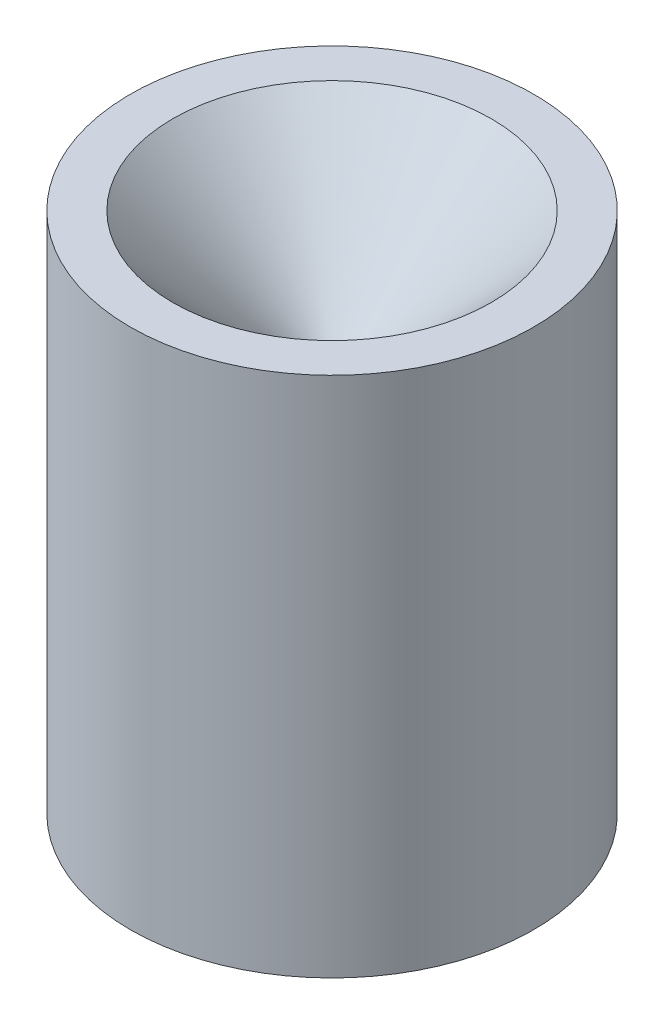
ISO-10303-21;
HEADER;
FILE_DESCRIPTION(('STEP AP214'),'2;1');
FILE_NAME('part.step','',(''),(''),'','','');
FILE_SCHEMA(('AUTOMOTIVE_DESIGN { 1 0 10303 214 1 1 1 1 }'));
ENDSEC;
DATA;
#1=APPLICATION_CONTEXT('core data for automotive mechanical design processes');
#2=APPLICATION_PROTOCOL_DEFINITION('international standard','automotive_design',2000,#1);
#3=PRODUCT_CONTEXT('',#1,'mechanical');
#4=PRODUCT('Part','Part','',(#3));
#5=PRODUCT_RELATED_PRODUCT_CATEGORY('part','',(#4));
#6=PRODUCT_DEFINITION_FORMATION('','',#4);
#7=PRODUCT_DEFINITION_CONTEXT('part definition',#1,'design');
#8=PRODUCT_DEFINITION('design','',#6,#7);
#9=PRODUCT_DEFINITION_SHAPE('','',#8);
#10=(LENGTH_UNIT() NAMED_UNIT(*) SI_UNIT(.MILLI.,.METRE.));
#11=(NAMED_UNIT(*) PLANE_ANGLE_UNIT() SI_UNIT($,.RADIAN.));
#12=(NAMED_UNIT(*) SI_UNIT($,.STERADIAN.) SOLID_ANGLE_UNIT());
#13=UNCERTAINTY_MEASURE_WITH_UNIT(LENGTH_MEASURE(1.E-05),#10,'distance_accuracy_value','');
#14=(GEOMETRIC_REPRESENTATION_CONTEXT(3) GLOBAL_UNCERTAINTY_ASSIGNED_CONTEXT((#13)) GLOBAL_UNIT_ASSIGNED_CONTEXT((#10,
#11,#12)) REPRESENTATION_CONTEXT('',''));
#15=CARTESIAN_POINT('',(0.,0.,0.));
#16=DIRECTION('',(0.,0.,1.));
#17=DIRECTION('',(1.,0.,0.));
#18=AXIS2_PLACEMENT_3D('',#15,#16,#17);
#19=CARTESIAN_POINT('',(0.,-51.0660710446308,0.));
#20=DIRECTION('',(0.,1.,0.));
#21=DIRECTION('',(0.,0.,1.));
#22=AXIS2_PLACEMENT_3D('',#19,#20,#21);
#23=PLANE('',#22);
#24=CARTESIAN_POINT('',(0.,-51.0660710446308,0.));
#25=DIRECTION('',(0.,1.,0.));
#26=DIRECTION('',(0.,0.,1.));
#27=AXIS2_PLACEMENT_3D('',#24,#25,#26);
#28=CIRCLE('',#27,30.1625);
#29=CARTESIAN_POINT('',(0.,-51.0660710446308,30.1625));
#30=VERTEX_POINT('',#29);
#31=EDGE_CURVE('E10',#30,#30,#28,.T.);
#32=ORIENTED_EDGE('',*,*,#31,.F.);
#33=EDGE_LOOP('',(#32));
#34=FACE_BOUND('',#33,.T.);
#35=CARTESIAN_POINT('',(0.,-51.0660710446308,0.));
#36=DIRECTION('',(0.,1.,0.));
#37=DIRECTION('',(0.,0.,1.));
#38=AXIS2_PLACEMENT_3D('',#35,#36,#37);
#39=CIRCLE('',#38,26.9875);
#40=CARTESIAN_POINT('',(0.,-51.0660710446308,26.9875));
#41=VERTEX_POINT('',#40);
#42=EDGE_CURVE('E66',#41,#41,#39,.T.);
#43=ORIENTED_EDGE('',*,*,#42,.T.);
#44=EDGE_LOOP('',(#43));
#45=FACE_BOUND('',#44,.T.);
#46=ADVANCED_FACE('F35',(#34,#45),#23,.F.);
#47=CARTESIAN_POINT('',(0.,0.,0.));
#48=DIRECTION('',(0.,1.,0.));
#49=DIRECTION('',(0.,0.,1.));
#50=AXIS2_PLACEMENT_3D('',#47,#48,#49);
#51=CYLINDRICAL_SURFACE('',#50,30.1625);
#52=CARTESIAN_POINT('',(0.,26.9874999999986,0.));
#53=DIRECTION('',(0.,1.,0.));
#54=DIRECTION('',(0.,0.,1.));
#55=AXIS2_PLACEMENT_3D('',#52,#53,#54);
#56=CIRCLE('',#55,30.1625);
#57=CARTESIAN_POINT('',(0.,26.9874999999986,30.1625));
#58=VERTEX_POINT('',#57);
#59=EDGE_CURVE('E42',#58,#58,#56,.T.);
#60=ORIENTED_EDGE('',*,*,#59,.F.);
#61=EDGE_LOOP('',(#60));
#62=FACE_BOUND('',#61,.T.);
#63=ORIENTED_EDGE('',*,*,#31,.T.);
#64=EDGE_LOOP('',(#63));
#65=FACE_BOUND('',#64,.T.);
#66=ADVANCED_FACE('F90',(#62,#65),#51,.T.);
#67=CARTESIAN_POINT('',(0.,26.9874999999986,0.));
#68=DIRECTION('',(0.,-1.,0.));
#69=DIRECTION('',(0.,0.,-1.));
#70=AXIS2_PLACEMENT_3D('',#67,#68,#69);
#71=PLANE('',#70);
#72=CARTESIAN_POINT('',(0.,26.9874999999986,0.));
#73=DIRECTION('',(0.,1.,0.));
#74=DIRECTION('',(0.,0.,1.));
#75=AXIS2_PLACEMENT_3D('',#72,#73,#74);
#76=CIRCLE('',#75,23.8125);
#77=CARTESIAN_POINT('',(0.,26.9874999999986,23.8125));
#78=VERTEX_POINT('',#77);
#79=EDGE_CURVE('E48',#78,#78,#76,.T.);
#80=ORIENTED_EDGE('',*,*,#79,.F.);
#81=EDGE_LOOP('',(#80));
#82=FACE_BOUND('',#81,.T.);
#83=ORIENTED_EDGE('',*,*,#59,.T.);
#84=EDGE_LOOP('',(#83));
#85=FACE_BOUND('',#84,.T.);
#86=ADVANCED_FACE('F95',(#82,#85),#71,.F.);
#87=CARTESIAN_POINT('',(0.,26.9874999999986,0.));
#88=DIRECTION('',(0.,1.,0.));
#89=DIRECTION('',(0.,0.,1.));
#90=AXIS2_PLACEMENT_3D('',#87,#88,#89);
#91=CONICAL_SURFACE('',#90,23.8125,0.785398163397451);
#92=CARTESIAN_POINT('',(0.,7.27993596973272,0.));
#93=DIRECTION('',(0.,1.,0.));
#94=DIRECTION('',(0.,0.,1.));
#95=AXIS2_PLACEMENT_3D('',#92,#93,#94);
#96=CIRCLE('',#95,4.1049359697341);
#97=CARTESIAN_POINT('',(0.,7.27993596973272,4.1049359697341));
#98=VERTEX_POINT('',#97);
#99=EDGE_CURVE('E52',#98,#98,#96,.T.);
#100=ORIENTED_EDGE('',*,*,#99,.F.);
#101=EDGE_LOOP('',(#100));
#102=FACE_BOUND('',#101,.T.);
#103=ORIENTED_EDGE('',*,*,#79,.T.);
#104=EDGE_LOOP('',(#103));
#105=FACE_BOUND('',#104,.T.);
#106=ADVANCED_FACE('F100',(#102,#105),#91,.F.);
#107=CARTESIAN_POINT('',(0.,5.03487193946542,0.));
#108=DIRECTION('',(0.,1.,0.));
#109=DIRECTION('',(0.,0.,1.));
#110=AXIS2_PLACEMENT_3D('',#107,#108,#109);
#111=TOROIDAL_SURFACE('',#110,6.35000000000137,3.175);
#112=ORIENTED_EDGE('',*,*,#99,.T.);
#113=EDGE_LOOP('',(#112));
#114=FACE_BOUND('',#113,.T.);
#115=CARTESIAN_POINT('',(0.,5.03487193946542,0.));
#116=DIRECTION('',(0.,1.,0.));
#117=DIRECTION('',(0.,0.,1.));
#118=AXIS2_PLACEMENT_3D('',#115,#116,#117);
#119=CIRCLE('',#118,3.17500000000137);
#120=CARTESIAN_POINT('',(0.,5.03487193946542,3.17500000000137));
#121=VERTEX_POINT('',#120);
#122=EDGE_CURVE('E57',#121,#121,#119,.T.);
#123=ORIENTED_EDGE('',*,*,#122,.F.);
#124=EDGE_LOOP('',(#123));
#125=FACE_BOUND('',#124,.T.);
#126=ADVANCED_FACE('F86',(#114,#125),#111,.T.);
#127=CARTESIAN_POINT('',(0.,0.,0.));
#128=DIRECTION('',(0.,1.,0.));
#129=DIRECTION('',(0.,0.,1.));
#130=AXIS2_PLACEMENT_3D('',#127,#128,#129);
#131=CYLINDRICAL_SURFACE('',#130,3.17500000000137);
#132=ORIENTED_EDGE('',*,*,#122,.T.);
#133=EDGE_LOOP('',(#132));
#134=FACE_BOUND('',#133,.T.);
#135=CARTESIAN_POINT('',(0.,0.703880553891333,0.));
#136=DIRECTION('',(0.,1.,0.));
#137=DIRECTION('',(0.,0.,1.));
#138=AXIS2_PLACEMENT_3D('',#135,#136,#137);
#139=CIRCLE('',#138,3.17500000000137);
#140=CARTESIAN_POINT('',(0.,0.703880553891333,3.17500000000137));
#141=VERTEX_POINT('',#140);
#142=EDGE_CURVE('E60',#141,#141,#139,.T.);
#143=ORIENTED_EDGE('',*,*,#142,.F.);
#144=EDGE_LOOP('',(#143));
#145=FACE_BOUND('',#144,.T.);
#146=ADVANCED_FACE('F80',(#134,#145),#131,.F.);
#147=CARTESIAN_POINT('',(0.,0.703880553891334,0.));
#148=DIRECTION('',(0.,1.,0.));
#149=DIRECTION('',(0.,0.,1.));
#150=AXIS2_PLACEMENT_3D('',#147,#148,#149);
#151=TOROIDAL_SURFACE('',#150,6.35000000000137,3.175);
#152=ORIENTED_EDGE('',*,*,#142,.T.);
#153=EDGE_LOOP('',(#152));
#154=FACE_BOUND('',#153,.T.);
#155=CARTESIAN_POINT('',(0.,-0.637932427135389,0.));
#156=DIRECTION('',(0.,1.,0.));
#157=DIRECTION('',(0.,0.,1.));
#158=AXIS2_PLACEMENT_3D('',#155,#156,#157);
#159=CIRCLE('',#158,3.47247277616001);
#160=CARTESIAN_POINT('',(0.,-0.637932427135389,3.47247277616001));
#161=VERTEX_POINT('',#160);
#162=EDGE_CURVE('E63',#161,#161,#159,.T.);
#163=ORIENTED_EDGE('',*,*,#162,.F.);
#164=EDGE_LOOP('',(#163));
#165=FACE_BOUND('',#164,.T.);
#166=ADVANCED_FACE('F75',(#154,#165),#151,.T.);
#167=CARTESIAN_POINT('',(0.,-0.637932427135389,0.));
#168=DIRECTION('',(0.,-1.,0.));
#169=DIRECTION('',(0.,0.,-1.));
#170=AXIS2_PLACEMENT_3D('',#167,#168,#169);
#171=CONICAL_SURFACE('',#170,3.47247277616001,0.436332312998583);
#172=ORIENTED_EDGE('',*,*,#42,.F.);
#173=EDGE_LOOP('',(#172));
#174=FACE_BOUND('',#173,.T.);
#175=ORIENTED_EDGE('',*,*,#162,.T.);
#176=EDGE_LOOP('',(#175));
#177=FACE_BOUND('',#176,.T.);
#178=ADVANCED_FACE('F72',(#174,#177),#171,.F.);
#179=CLOSED_SHELL('',(#46,#66,#86,#106,#126,#146,#166,#178));
#180=MANIFOLD_SOLID_BREP('B2',#179);
#181=ADVANCED_BREP_SHAPE_REPRESENTATION('',(#18,#180),#14);
#182=SHAPE_DEFINITION_REPRESENTATION(#9,#181);
ENDSEC;
END-ISO-10303-21;
